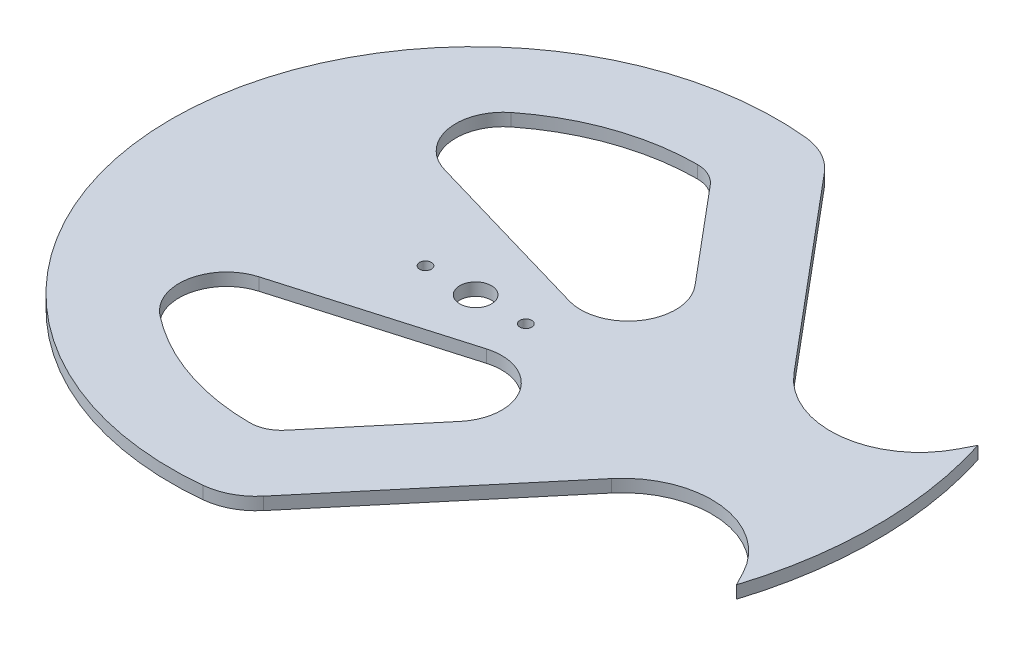
ISO-10303-21;
HEADER;
FILE_DESCRIPTION(('STEP AP214'),'2;1');
FILE_NAME('part.step','',(''),(''),'','','');
FILE_SCHEMA(('AUTOMOTIVE_DESIGN { 1 0 10303 214 1 1 1 1 }'));
ENDSEC;
DATA;
#1=APPLICATION_CONTEXT('core data for automotive mechanical design processes');
#2=APPLICATION_PROTOCOL_DEFINITION('international standard','automotive_design',2000,#1);
#3=PRODUCT_CONTEXT('',#1,'mechanical');
#4=PRODUCT('Part','Part','',(#3));
#5=PRODUCT_RELATED_PRODUCT_CATEGORY('part','',(#4));
#6=PRODUCT_DEFINITION_FORMATION('','',#4);
#7=PRODUCT_DEFINITION_CONTEXT('part definition',#1,'design');
#8=PRODUCT_DEFINITION('design','',#6,#7);
#9=PRODUCT_DEFINITION_SHAPE('','',#8);
#10=(LENGTH_UNIT() NAMED_UNIT(*) SI_UNIT(.MILLI.,.METRE.));
#11=(NAMED_UNIT(*) PLANE_ANGLE_UNIT() SI_UNIT($,.RADIAN.));
#12=(NAMED_UNIT(*) SI_UNIT($,.STERADIAN.) SOLID_ANGLE_UNIT());
#13=UNCERTAINTY_MEASURE_WITH_UNIT(LENGTH_MEASURE(1.E-05),#10,'distance_accuracy_value','');
#14=(GEOMETRIC_REPRESENTATION_CONTEXT(3) GLOBAL_UNCERTAINTY_ASSIGNED_CONTEXT((#13)) GLOBAL_UNIT_ASSIGNED_CONTEXT((#10,
#11,#12)) REPRESENTATION_CONTEXT('',''));
#15=CARTESIAN_POINT('',(0.,0.,0.));
#16=DIRECTION('',(0.,0.,1.));
#17=DIRECTION('',(1.,0.,0.));
#18=AXIS2_PLACEMENT_3D('',#15,#16,#17);
#19=CARTESIAN_POINT('',(0.,3.175,0.));
#20=DIRECTION('',(0.,-1.,0.));
#21=DIRECTION('',(0.,0.,-1.));
#22=AXIS2_PLACEMENT_3D('',#19,#20,#21);
#23=PLANE('',#22);
#24=CARTESIAN_POINT('',(-12.3213636381128,3.175,0.));
#25=DIRECTION('',(0.,1.,0.));
#26=DIRECTION('',(0.,0.,1.));
#27=AXIS2_PLACEMENT_3D('',#24,#25,#26);
#28=CIRCLE('',#27,1.5);
#29=CARTESIAN_POINT('',(-12.3213636381128,3.175,1.5));
#30=VERTEX_POINT('',#29);
#31=EDGE_CURVE('E713',#30,#30,#28,.T.);
#32=ORIENTED_EDGE('',*,*,#31,.F.);
#33=EDGE_LOOP('',(#32));
#34=FACE_BOUND('',#33,.T.);
#35=CARTESIAN_POINT('',(13.0786363618872,3.175,0.));
#36=DIRECTION('',(0.,1.,0.));
#37=DIRECTION('',(0.,0.,1.));
#38=AXIS2_PLACEMENT_3D('',#35,#36,#37);
#39=CIRCLE('',#38,1.5);
#40=CARTESIAN_POINT('',(13.0786363618872,3.175,1.5));
#41=VERTEX_POINT('',#40);
#42=EDGE_CURVE('E718',#41,#41,#39,.T.);
#43=ORIENTED_EDGE('',*,*,#42,.F.);
#44=EDGE_LOOP('',(#43));
#45=FACE_BOUND('',#44,.T.);
#46=CARTESIAN_POINT('',(0.378636361887175,3.175,0.));
#47=DIRECTION('',(0.,1.,0.));
#48=DIRECTION('',(0.,0.,1.));
#49=AXIS2_PLACEMENT_3D('',#46,#47,#48);
#50=CIRCLE('',#49,4.);
#51=CARTESIAN_POINT('',(0.378636361887175,3.175,4.));
#52=VERTEX_POINT('',#51);
#53=EDGE_CURVE('E230',#52,#52,#50,.T.);
#54=ORIENTED_EDGE('',*,*,#53,.F.);
#55=EDGE_LOOP('',(#54));
#56=FACE_BOUND('',#55,.T.);
#57=CARTESIAN_POINT('',(-0.144220654744044,3.175,-48.5997860119028));
#58=DIRECTION('',(0.,1.,0.));
#59=DIRECTION('',(0.,0.,-1.));
#60=AXIS2_PLACEMENT_3D('',#57,#58,#59);
#61=CIRCLE('',#60,8.);
#62=CARTESIAN_POINT('',(5.98413489020778,3.175,-53.7420868893951));
#63=VERTEX_POINT('',#62);
#64=CARTESIAN_POINT('',(-0.167960680216297,3.175,-56.5997507875247));
#65=VERTEX_POINT('',#64);
#66=EDGE_CURVE('E260',#63,#65,#61,.T.);
#67=ORIENTED_EDGE('',*,*,#66,.F.);
#68=DIRECTION('',(-0.642787609686538,0.,-0.766044443118979));
#69=VECTOR('',#68,1.);
#70=CARTESIAN_POINT('',(5.98413489020778,3.175,-53.7420868893951));
#71=LINE('',#70,#69);
#72=CARTESIAN_POINT('',(26.1465541373368,3.175,-29.7134513162384));
#73=VERTEX_POINT('',#72);
#74=EDGE_CURVE('E277',#73,#63,#71,.T.);
#75=ORIENTED_EDGE('',*,*,#74,.F.);
#76=CARTESIAN_POINT('',(16.954020819909,3.175,-22.));
#77=DIRECTION('',(0.,1.,0.));
#78=DIRECTION('',(0.,0.,-1.));
#79=AXIS2_PLACEMENT_3D('',#76,#77,#78);
#80=CIRCLE('',#79,12.);
#81=CARTESIAN_POINT('',(13.595828747128,3.175,-10.4794728418223));
#82=VERTEX_POINT('',#81);
#83=EDGE_CURVE('E273',#82,#73,#80,.T.);
#84=ORIENTED_EDGE('',*,*,#83,.F.);
#85=DIRECTION('',(0.960043929848145,0.,0.279849339398417));
#86=VECTOR('',#85,1.);
#87=CARTESIAN_POINT('',(13.595828747128,3.175,-10.4794728418223));
#88=LINE('',#87,#86);
#89=CARTESIAN_POINT('',(-31.0016361418546,3.175,-23.4794728418223));
#90=VERTEX_POINT('',#89);
#91=EDGE_CURVE('E270',#90,#82,#88,.T.);
#92=ORIENTED_EDGE('',*,*,#91,.F.);
#93=CARTESIAN_POINT('',(-27.6434440690736,3.175,-35.));
#94=DIRECTION('',(0.,1.,0.));
#95=DIRECTION('',(0.,0.,1.));
#96=AXIS2_PLACEMENT_3D('',#93,#94,#95);
#97=CIRCLE('',#96,12.);
#98=CARTESIAN_POINT('',(-35.0811420248781,3.175,-44.4170403587444));
#99=VERTEX_POINT('',#98);
#100=EDGE_CURVE('E267',#99,#90,#97,.T.);
#101=ORIENTED_EDGE('',*,*,#100,.F.);
#102=CARTESIAN_POINT('',(0.,3.175,0.));
#103=DIRECTION('',(0.,1.,0.));
#104=DIRECTION('',(0.,0.,1.));
#105=AXIS2_PLACEMENT_3D('',#102,#103,#104);
#106=CIRCLE('',#105,56.6);
#107=EDGE_CURVE('E263',#65,#99,#106,.T.);
#108=ORIENTED_EDGE('',*,*,#107,.F.);
#109=EDGE_LOOP('',(#67,#75,#84,#92,#101,#108));
#110=FACE_BOUND('',#109,.T.);
#111=CARTESIAN_POINT('',(0.,3.175,0.));
#112=DIRECTION('',(0.,1.,0.));
#113=DIRECTION('',(0.,0.,-1.));
#114=AXIS2_PLACEMENT_3D('',#111,#112,#113);
#115=CIRCLE('',#114,101.6);
#116=CARTESIAN_POINT('',(96.8976421960199,3.175,30.5517092296339));
#117=VERTEX_POINT('',#116);
#118=CARTESIAN_POINT('',(96.8976421960199,3.175,-30.5517092296339));
#119=VERTEX_POINT('',#118);
#120=EDGE_CURVE('E323',#117,#119,#115,.T.);
#121=ORIENTED_EDGE('',*,*,#120,.T.);
#122=DIRECTION('',(-0.461748613235041,0.,0.887010833178218));
#123=VECTOR('',#122,1.);
#124=CARTESIAN_POINT('',(96.8976421960199,3.175,-30.5517092296339));
#125=LINE('',#124,#123);
#126=CARTESIAN_POINT('',(95.1209457916625,3.175,-27.1387071918094));
#127=VERTEX_POINT('',#126);
#128=EDGE_CURVE('E327',#119,#127,#125,.T.);
#129=ORIENTED_EDGE('',*,*,#128,.T.);
#130=CARTESIAN_POINT('',(75.1169754449685,3.175,-37.5521150345125));
#131=DIRECTION('',(0.,-1.,0.));
#132=DIRECTION('',(0.,0.,-1.));
#133=AXIS2_PLACEMENT_3D('',#130,#131,#132);
#134=CIRCLE('',#133,22.5521150345125);
#135=CARTESIAN_POINT('',(57.8410530422002,3.175,-23.0558949181024));
#136=VERTEX_POINT('',#135);
#137=EDGE_CURVE('E331',#127,#136,#134,.T.);
#138=ORIENTED_EDGE('',*,*,#137,.T.);
#139=DIRECTION('',(-0.642787609686538,0.,-0.766044443118979));
#140=VECTOR('',#139,1.);
#141=CARTESIAN_POINT('',(17.668897816436,3.175,-70.9312052306592));
#142=LINE('',#141,#140);
#143=CARTESIAN_POINT('',(17.668897816436,3.175,-70.9312052306592));
#144=VERTEX_POINT('',#143);
#145=EDGE_CURVE('E334',#136,#144,#142,.T.);
#146=ORIENTED_EDGE('',*,*,#145,.T.);
#147=CARTESIAN_POINT('',(6.17823116965135,3.175,-61.2893910853612));
#148=DIRECTION('',(0.,1.,0.));
#149=DIRECTION('',(0.,0.,-1.));
#150=AXIS2_PLACEMENT_3D('',#147,#148,#149);
#151=CIRCLE('',#150,15.);
#152=CARTESIAN_POINT('',(7.68267057784568,3.175,-76.2137557977056));
#153=VERTEX_POINT('',#152);
#154=EDGE_CURVE('E337',#144,#153,#151,.T.);
#155=ORIENTED_EDGE('',*,*,#154,.T.);
#156=CARTESIAN_POINT('',(0.,3.175,0.));
#157=DIRECTION('',(0.,1.,0.));
#158=DIRECTION('',(0.,0.,1.));
#159=AXIS2_PLACEMENT_3D('',#156,#157,#158);
#160=CIRCLE('',#159,76.6);
#161=CARTESIAN_POINT('',(7.68267057784568,3.175,76.2137557977056));
#162=VERTEX_POINT('',#161);
#163=EDGE_CURVE('E340',#153,#162,#160,.T.);
#164=ORIENTED_EDGE('',*,*,#163,.T.);
#165=CARTESIAN_POINT('',(6.17823116965135,3.175,61.2893910853612));
#166=DIRECTION('',(0.,1.,0.));
#167=DIRECTION('',(0.,0.,1.));
#168=AXIS2_PLACEMENT_3D('',#165,#166,#167);
#169=CIRCLE('',#168,15.);
#170=CARTESIAN_POINT('',(17.668897816436,3.175,70.9312052306592));
#171=VERTEX_POINT('',#170);
#172=EDGE_CURVE('E343',#162,#171,#169,.T.);
#173=ORIENTED_EDGE('',*,*,#172,.T.);
#174=DIRECTION('',(0.642787609686538,0.,-0.766044443118979));
#175=VECTOR('',#174,1.);
#176=CARTESIAN_POINT('',(17.668897816436,3.175,70.9312052306592));
#177=LINE('',#176,#175);
#178=CARTESIAN_POINT('',(57.8410530422002,3.175,23.0558949181024));
#179=VERTEX_POINT('',#178);
#180=EDGE_CURVE('E346',#171,#179,#177,.T.);
#181=ORIENTED_EDGE('',*,*,#180,.T.);
#182=CARTESIAN_POINT('',(75.1169754449685,3.175,37.5521150345125));
#183=DIRECTION('',(0.,-1.,0.));
#184=DIRECTION('',(0.,0.,1.));
#185=AXIS2_PLACEMENT_3D('',#182,#183,#184);
#186=CIRCLE('',#185,22.5521150345125);
#187=CARTESIAN_POINT('',(95.1209457916625,3.175,27.1387071918094));
#188=VERTEX_POINT('',#187);
#189=EDGE_CURVE('E349',#179,#188,#186,.T.);
#190=ORIENTED_EDGE('',*,*,#189,.T.);
#191=DIRECTION('',(0.461748613235041,0.,0.887010833178218));
#192=VECTOR('',#191,1.);
#193=CARTESIAN_POINT('',(96.8976421960199,3.175,30.5517092296339));
#194=LINE('',#193,#192);
#195=EDGE_CURVE('E352',#188,#117,#194,.T.);
#196=ORIENTED_EDGE('',*,*,#195,.T.);
#197=EDGE_LOOP('',(#121,#129,#138,#146,#155,#164,#173,#181,#190,#196));
#198=FACE_BOUND('',#197,.T.);
#199=CARTESIAN_POINT('',(16.954020819909,3.175,22.));
#200=DIRECTION('',(0.,1.,0.));
#201=DIRECTION('',(0.,0.,1.));
#202=AXIS2_PLACEMENT_3D('',#199,#200,#201);
#203=CIRCLE('',#202,12.);
#204=CARTESIAN_POINT('',(26.1465541373368,3.175,29.7134513162384));
#205=VERTEX_POINT('',#204);
#206=CARTESIAN_POINT('',(13.595828747128,3.175,10.4794728418223));
#207=VERTEX_POINT('',#206);
#208=EDGE_CURVE('E189',#205,#207,#203,.T.);
#209=ORIENTED_EDGE('',*,*,#208,.F.);
#210=DIRECTION('',(0.642787609686538,0.,-0.766044443118979));
#211=VECTOR('',#210,1.);
#212=CARTESIAN_POINT('',(5.98413489020778,3.175,53.7420868893951));
#213=LINE('',#212,#211);
#214=CARTESIAN_POINT('',(5.98413489020779,3.175,53.7420868893951));
#215=VERTEX_POINT('',#214);
#216=EDGE_CURVE('E225',#215,#205,#213,.T.);
#217=ORIENTED_EDGE('',*,*,#216,.F.);
#218=CARTESIAN_POINT('',(-0.144220654744044,3.175,48.5997860119028));
#219=DIRECTION('',(0.,1.,0.));
#220=DIRECTION('',(0.,0.,1.));
#221=AXIS2_PLACEMENT_3D('',#218,#219,#220);
#222=CIRCLE('',#221,8.);
#223=CARTESIAN_POINT('',(-0.167960680216315,3.175,56.5997507875247));
#224=VERTEX_POINT('',#223);
#225=EDGE_CURVE('E222',#224,#215,#222,.T.);
#226=ORIENTED_EDGE('',*,*,#225,.F.);
#227=CARTESIAN_POINT('',(0.,3.175,0.));
#228=DIRECTION('',(0.,1.,0.));
#229=DIRECTION('',(0.,0.,-1.));
#230=AXIS2_PLACEMENT_3D('',#227,#228,#229);
#231=CIRCLE('',#230,56.6);
#232=CARTESIAN_POINT('',(-35.0811420248781,3.175,44.4170403587444));
#233=VERTEX_POINT('',#232);
#234=EDGE_CURVE('E216',#233,#224,#231,.T.);
#235=ORIENTED_EDGE('',*,*,#234,.F.);
#236=CARTESIAN_POINT('',(-27.6434440690736,3.175,35.));
#237=DIRECTION('',(0.,1.,0.));
#238=DIRECTION('',(0.,0.,-1.));
#239=AXIS2_PLACEMENT_3D('',#236,#237,#238);
#240=CIRCLE('',#239,12.);
#241=CARTESIAN_POINT('',(-31.0016361418546,3.175,23.4794728418223));
#242=VERTEX_POINT('',#241);
#243=EDGE_CURVE('E212',#242,#233,#240,.T.);
#244=ORIENTED_EDGE('',*,*,#243,.F.);
#245=DIRECTION('',(-0.960043929848145,0.,0.279849339398417));
#246=VECTOR('',#245,1.);
#247=CARTESIAN_POINT('',(13.595828747128,3.175,10.4794728418223));
#248=LINE('',#247,#246);
#249=EDGE_CURVE('E198',#207,#242,#248,.T.);
#250=ORIENTED_EDGE('',*,*,#249,.F.);
#251=EDGE_LOOP('',(#209,#217,#226,#235,#244,#250));
#252=FACE_BOUND('',#251,.T.);
#253=ADVANCED_FACE('F39',(#34,#45,#56,#110,#198,#252),#23,.F.);
#254=CARTESIAN_POINT('',(0.,0.,0.));
#255=DIRECTION('',(0.,-1.,0.));
#256=DIRECTION('',(0.,0.,-1.));
#257=AXIS2_PLACEMENT_3D('',#254,#255,#256);
#258=PLANE('',#257);
#259=CARTESIAN_POINT('',(-12.3213636381128,0.,0.));
#260=DIRECTION('',(0.,1.,0.));
#261=DIRECTION('',(0.,0.,1.));
#262=AXIS2_PLACEMENT_3D('',#259,#260,#261);
#263=CIRCLE('',#262,1.5);
#264=CARTESIAN_POINT('',(-12.3213636381128,0.,1.5));
#265=VERTEX_POINT('',#264);
#266=EDGE_CURVE('E716',#265,#265,#263,.T.);
#267=ORIENTED_EDGE('',*,*,#266,.T.);
#268=EDGE_LOOP('',(#267));
#269=FACE_BOUND('',#268,.T.);
#270=CARTESIAN_POINT('',(13.0786363618872,0.,0.));
#271=DIRECTION('',(0.,1.,0.));
#272=DIRECTION('',(0.,0.,1.));
#273=AXIS2_PLACEMENT_3D('',#270,#271,#272);
#274=CIRCLE('',#273,1.5);
#275=CARTESIAN_POINT('',(13.0786363618872,0.,1.5));
#276=VERTEX_POINT('',#275);
#277=EDGE_CURVE('E725',#276,#276,#274,.T.);
#278=ORIENTED_EDGE('',*,*,#277,.T.);
#279=EDGE_LOOP('',(#278));
#280=FACE_BOUND('',#279,.T.);
#281=CARTESIAN_POINT('',(0.378636361887175,0.,0.));
#282=DIRECTION('',(0.,1.,0.));
#283=DIRECTION('',(0.,0.,1.));
#284=AXIS2_PLACEMENT_3D('',#281,#282,#283);
#285=CIRCLE('',#284,4.);
#286=CARTESIAN_POINT('',(0.378636361887175,0.,4.));
#287=VERTEX_POINT('',#286);
#288=EDGE_CURVE('E722',#287,#287,#285,.T.);
#289=ORIENTED_EDGE('',*,*,#288,.T.);
#290=EDGE_LOOP('',(#289));
#291=FACE_BOUND('',#290,.T.);
#292=CARTESIAN_POINT('',(0.,0.,0.));
#293=DIRECTION('',(0.,1.,0.));
#294=DIRECTION('',(0.,0.,-1.));
#295=AXIS2_PLACEMENT_3D('',#292,#293,#294);
#296=CIRCLE('',#295,101.6);
#297=CARTESIAN_POINT('',(96.8976421960199,0.,30.5517092296339));
#298=VERTEX_POINT('',#297);
#299=CARTESIAN_POINT('',(96.8976421960199,0.,-30.5517092296339));
#300=VERTEX_POINT('',#299);
#301=EDGE_CURVE('E322',#298,#300,#296,.T.);
#302=ORIENTED_EDGE('',*,*,#301,.F.);
#303=DIRECTION('',(0.461748613235041,0.,0.887010833178218));
#304=VECTOR('',#303,1.);
#305=CARTESIAN_POINT('',(96.8976421960199,0.,30.5517092296339));
#306=LINE('',#305,#304);
#307=CARTESIAN_POINT('',(95.1209457916625,0.,27.1387071918094));
#308=VERTEX_POINT('',#307);
#309=EDGE_CURVE('E328',#308,#298,#306,.T.);
#310=ORIENTED_EDGE('',*,*,#309,.F.);
#311=CARTESIAN_POINT('',(75.1169754449685,0.,37.5521150345125));
#312=DIRECTION('',(0.,-1.,0.));
#313=DIRECTION('',(0.,0.,1.));
#314=AXIS2_PLACEMENT_3D('',#311,#312,#313);
#315=CIRCLE('',#314,22.5521150345125);
#316=CARTESIAN_POINT('',(57.8410530422002,0.,23.0558949181024));
#317=VERTEX_POINT('',#316);
#318=EDGE_CURVE('E380',#317,#308,#315,.T.);
#319=ORIENTED_EDGE('',*,*,#318,.F.);
#320=DIRECTION('',(0.642787609686538,0.,-0.766044443118979));
#321=VECTOR('',#320,1.);
#322=CARTESIAN_POINT('',(17.668897816436,0.,70.9312052306592));
#323=LINE('',#322,#321);
#324=CARTESIAN_POINT('',(17.668897816436,0.,70.9312052306592));
#325=VERTEX_POINT('',#324);
#326=EDGE_CURVE('E377',#325,#317,#323,.T.);
#327=ORIENTED_EDGE('',*,*,#326,.F.);
#328=CARTESIAN_POINT('',(6.17823116965135,0.,61.2893910853612));
#329=DIRECTION('',(0.,1.,0.));
#330=DIRECTION('',(0.,0.,1.));
#331=AXIS2_PLACEMENT_3D('',#328,#329,#330);
#332=CIRCLE('',#331,15.);
#333=CARTESIAN_POINT('',(7.68267057784568,0.,76.2137557977056));
#334=VERTEX_POINT('',#333);
#335=EDGE_CURVE('E374',#334,#325,#332,.T.);
#336=ORIENTED_EDGE('',*,*,#335,.F.);
#337=CARTESIAN_POINT('',(0.,0.,0.));
#338=DIRECTION('',(0.,1.,0.));
#339=DIRECTION('',(0.,0.,1.));
#340=AXIS2_PLACEMENT_3D('',#337,#338,#339);
#341=CIRCLE('',#340,76.6);
#342=CARTESIAN_POINT('',(7.68267057784568,0.,-76.2137557977056));
#343=VERTEX_POINT('',#342);
#344=EDGE_CURVE('E371',#343,#334,#341,.T.);
#345=ORIENTED_EDGE('',*,*,#344,.F.);
#346=CARTESIAN_POINT('',(6.17823116965135,0.,-61.2893910853612));
#347=DIRECTION('',(0.,1.,0.));
#348=DIRECTION('',(0.,0.,-1.));
#349=AXIS2_PLACEMENT_3D('',#346,#347,#348);
#350=CIRCLE('',#349,15.);
#351=CARTESIAN_POINT('',(17.668897816436,0.,-70.9312052306592));
#352=VERTEX_POINT('',#351);
#353=EDGE_CURVE('E368',#352,#343,#350,.T.);
#354=ORIENTED_EDGE('',*,*,#353,.F.);
#355=DIRECTION('',(-0.642787609686538,0.,-0.766044443118979));
#356=VECTOR('',#355,1.);
#357=CARTESIAN_POINT('',(17.668897816436,0.,-70.9312052306592));
#358=LINE('',#357,#356);
#359=CARTESIAN_POINT('',(57.8410530422002,0.,-23.0558949181024));
#360=VERTEX_POINT('',#359);
#361=EDGE_CURVE('E365',#360,#352,#358,.T.);
#362=ORIENTED_EDGE('',*,*,#361,.F.);
#363=CARTESIAN_POINT('',(75.1169754449685,0.,-37.5521150345125));
#364=DIRECTION('',(0.,-1.,0.));
#365=DIRECTION('',(0.,0.,-1.));
#366=AXIS2_PLACEMENT_3D('',#363,#364,#365);
#367=CIRCLE('',#366,22.5521150345125);
#368=CARTESIAN_POINT('',(95.1209457916625,0.,-27.1387071918094));
#369=VERTEX_POINT('',#368);
#370=EDGE_CURVE('E362',#369,#360,#367,.T.);
#371=ORIENTED_EDGE('',*,*,#370,.F.);
#372=DIRECTION('',(-0.461748613235041,0.,0.887010833178218));
#373=VECTOR('',#372,1.);
#374=CARTESIAN_POINT('',(96.8976421960199,0.,-30.5517092296339));
#375=LINE('',#374,#373);
#376=EDGE_CURVE('E359',#300,#369,#375,.T.);
#377=ORIENTED_EDGE('',*,*,#376,.F.);
#378=EDGE_LOOP('',(#302,#310,#319,#327,#336,#345,#354,#362,#371,#377));
#379=FACE_BOUND('',#378,.T.);
#380=DIRECTION('',(-0.642787609686538,0.,-0.766044443118979));
#381=VECTOR('',#380,1.);
#382=CARTESIAN_POINT('',(5.98413489020778,0.,-53.7420868893951));
#383=LINE('',#382,#381);
#384=CARTESIAN_POINT('',(26.1465541373368,0.,-29.7134513162384));
#385=VERTEX_POINT('',#384);
#386=CARTESIAN_POINT('',(5.98413489020779,0.,-53.7420868893951));
#387=VERTEX_POINT('',#386);
#388=EDGE_CURVE('E264',#385,#387,#383,.T.);
#389=ORIENTED_EDGE('',*,*,#388,.T.);
#390=CARTESIAN_POINT('',(-0.144220654744044,0.,-48.5997860119028));
#391=DIRECTION('',(0.,1.,0.));
#392=DIRECTION('',(0.,0.,-1.));
#393=AXIS2_PLACEMENT_3D('',#390,#391,#392);
#394=CIRCLE('',#393,8.);
#395=CARTESIAN_POINT('',(-0.167960680216297,0.,-56.5997507875247));
#396=VERTEX_POINT('',#395);
#397=EDGE_CURVE('E207',#387,#396,#394,.T.);
#398=ORIENTED_EDGE('',*,*,#397,.T.);
#399=CARTESIAN_POINT('',(0.,0.,0.));
#400=DIRECTION('',(0.,1.,0.));
#401=DIRECTION('',(0.,0.,1.));
#402=AXIS2_PLACEMENT_3D('',#399,#400,#401);
#403=CIRCLE('',#402,56.6);
#404=CARTESIAN_POINT('',(-35.0811420248781,0.,-44.4170403587444));
#405=VERTEX_POINT('',#404);
#406=EDGE_CURVE('E284',#396,#405,#403,.T.);
#407=ORIENTED_EDGE('',*,*,#406,.T.);
#408=CARTESIAN_POINT('',(-27.6434440690736,0.,-35.));
#409=DIRECTION('',(0.,1.,0.));
#410=DIRECTION('',(0.,0.,1.));
#411=AXIS2_PLACEMENT_3D('',#408,#409,#410);
#412=CIRCLE('',#411,12.);
#413=CARTESIAN_POINT('',(-31.0016361418546,0.,-23.4794728418223));
#414=VERTEX_POINT('',#413);
#415=EDGE_CURVE('E288',#405,#414,#412,.T.);
#416=ORIENTED_EDGE('',*,*,#415,.T.);
#417=DIRECTION('',(0.960043929848145,0.,0.279849339398417));
#418=VECTOR('',#417,1.);
#419=CARTESIAN_POINT('',(13.595828747128,0.,-10.4794728418223));
#420=LINE('',#419,#418);
#421=CARTESIAN_POINT('',(13.595828747128,0.,-10.4794728418223));
#422=VERTEX_POINT('',#421);
#423=EDGE_CURVE('E292',#414,#422,#420,.T.);
#424=ORIENTED_EDGE('',*,*,#423,.T.);
#425=CARTESIAN_POINT('',(16.954020819909,0.,-22.));
#426=DIRECTION('',(0.,1.,0.));
#427=DIRECTION('',(0.,0.,-1.));
#428=AXIS2_PLACEMENT_3D('',#425,#426,#427);
#429=CIRCLE('',#428,12.);
#430=EDGE_CURVE('E296',#422,#385,#429,.T.);
#431=ORIENTED_EDGE('',*,*,#430,.T.);
#432=EDGE_LOOP('',(#389,#398,#407,#416,#424,#431));
#433=FACE_BOUND('',#432,.T.);
#434=DIRECTION('',(0.642787609686538,0.,-0.766044443118979));
#435=VECTOR('',#434,1.);
#436=CARTESIAN_POINT('',(5.98413489020778,0.,53.7420868893951));
#437=LINE('',#436,#435);
#438=CARTESIAN_POINT('',(5.98413489020778,0.,53.7420868893951));
#439=VERTEX_POINT('',#438);
#440=CARTESIAN_POINT('',(26.1465541373368,0.,29.7134513162384));
#441=VERTEX_POINT('',#440);
#442=EDGE_CURVE('E199',#439,#441,#437,.T.);
#443=ORIENTED_EDGE('',*,*,#442,.T.);
#444=CARTESIAN_POINT('',(16.954020819909,0.,22.));
#445=DIRECTION('',(0.,1.,0.));
#446=DIRECTION('',(0.,0.,1.));
#447=AXIS2_PLACEMENT_3D('',#444,#445,#446);
#448=CIRCLE('',#447,12.);
#449=CARTESIAN_POINT('',(13.595828747128,0.,10.4794728418223));
#450=VERTEX_POINT('',#449);
#451=EDGE_CURVE('E63',#441,#450,#448,.T.);
#452=ORIENTED_EDGE('',*,*,#451,.T.);
#453=DIRECTION('',(-0.960043929848145,0.,0.279849339398417));
#454=VECTOR('',#453,1.);
#455=CARTESIAN_POINT('',(13.595828747128,0.,10.4794728418223));
#456=LINE('',#455,#454);
#457=CARTESIAN_POINT('',(-31.0016361418546,0.,23.4794728418223));
#458=VERTEX_POINT('',#457);
#459=EDGE_CURVE('E205',#450,#458,#456,.T.);
#460=ORIENTED_EDGE('',*,*,#459,.T.);
#461=CARTESIAN_POINT('',(-27.6434440690736,0.,35.));
#462=DIRECTION('',(0.,1.,0.));
#463=DIRECTION('',(0.,0.,-1.));
#464=AXIS2_PLACEMENT_3D('',#461,#462,#463);
#465=CIRCLE('',#464,12.);
#466=CARTESIAN_POINT('',(-35.0811420248781,0.,44.4170403587444));
#467=VERTEX_POINT('',#466);
#468=EDGE_CURVE('E233',#458,#467,#465,.T.);
#469=ORIENTED_EDGE('',*,*,#468,.T.);
#470=CARTESIAN_POINT('',(0.,0.,0.));
#471=DIRECTION('',(0.,1.,0.));
#472=DIRECTION('',(0.,0.,-1.));
#473=AXIS2_PLACEMENT_3D('',#470,#471,#472);
#474=CIRCLE('',#473,56.6);
#475=CARTESIAN_POINT('',(-0.167960680216315,0.,56.5997507875247));
#476=VERTEX_POINT('',#475);
#477=EDGE_CURVE('E237',#467,#476,#474,.T.);
#478=ORIENTED_EDGE('',*,*,#477,.T.);
#479=CARTESIAN_POINT('',(-0.144220654744044,0.,48.5997860119028));
#480=DIRECTION('',(0.,1.,0.));
#481=DIRECTION('',(0.,0.,1.));
#482=AXIS2_PLACEMENT_3D('',#479,#480,#481);
#483=CIRCLE('',#482,8.);
#484=EDGE_CURVE('E241',#476,#439,#483,.T.);
#485=ORIENTED_EDGE('',*,*,#484,.T.);
#486=EDGE_LOOP('',(#443,#452,#460,#469,#478,#485));
#487=FACE_BOUND('',#486,.T.);
#488=ADVANCED_FACE('F427',(#269,#280,#291,#379,#433,#487),#258,.T.);
#489=CARTESIAN_POINT('',(0.,3.175,0.));
#490=DIRECTION('',(0.,-1.,0.));
#491=DIRECTION('',(0.,0.,-1.));
#492=AXIS2_PLACEMENT_3D('',#489,#490,#491);
#493=CYLINDRICAL_SURFACE('',#492,101.6);
#494=ORIENTED_EDGE('',*,*,#301,.T.);
#495=DIRECTION('',(0.,-1.,0.));
#496=VECTOR('',#495,1.);
#497=CARTESIAN_POINT('',(96.8976421960199,3.175,-30.5517092296339));
#498=LINE('',#497,#496);
#499=EDGE_CURVE('E11',#119,#300,#498,.T.);
#500=ORIENTED_EDGE('',*,*,#499,.F.);
#501=ORIENTED_EDGE('',*,*,#120,.F.);
#502=DIRECTION('',(0.,-1.,0.));
#503=VECTOR('',#502,1.);
#504=CARTESIAN_POINT('',(96.8976421960199,3.175,30.5517092296339));
#505=LINE('',#504,#503);
#506=EDGE_CURVE('E355',#117,#298,#505,.T.);
#507=ORIENTED_EDGE('',*,*,#506,.T.);
#508=EDGE_LOOP('',(#494,#500,#501,#507));
#509=FACE_BOUND('',#508,.T.);
#510=ADVANCED_FACE('F41',(#509),#493,.T.);
#511=CARTESIAN_POINT('',(96.8976421960199,3.175,-30.5517092296339));
#512=DIRECTION('',(0.887010833178218,0.,0.461748613235041));
#513=DIRECTION('',(0.461748613235041,0.,-0.887010833178218));
#514=AXIS2_PLACEMENT_3D('',#511,#512,#513);
#515=PLANE('',#514);
#516=ORIENTED_EDGE('',*,*,#376,.T.);
#517=DIRECTION('',(0.,-1.,0.));
#518=VECTOR('',#517,1.);
#519=CARTESIAN_POINT('',(95.1209457916625,3.175,-27.1387071918094));
#520=LINE('',#519,#518);
#521=EDGE_CURVE('E48',#127,#369,#520,.T.);
#522=ORIENTED_EDGE('',*,*,#521,.F.);
#523=ORIENTED_EDGE('',*,*,#128,.F.);
#524=ORIENTED_EDGE('',*,*,#499,.T.);
#525=EDGE_LOOP('',(#516,#522,#523,#524));
#526=FACE_BOUND('',#525,.T.);
#527=ADVANCED_FACE('F444',(#526),#515,.F.);
#528=CARTESIAN_POINT('',(75.1169754449685,3.175,-37.5521150345125));
#529=DIRECTION('',(0.,-1.,0.));
#530=DIRECTION('',(0.,0.,-1.));
#531=AXIS2_PLACEMENT_3D('',#528,#529,#530);
#532=CYLINDRICAL_SURFACE('',#531,22.5521150345125);
#533=ORIENTED_EDGE('',*,*,#370,.T.);
#534=DIRECTION('',(0.,-1.,0.));
#535=VECTOR('',#534,1.);
#536=CARTESIAN_POINT('',(57.8410530422002,3.175,-23.0558949181024));
#537=LINE('',#536,#535);
#538=EDGE_CURVE('E412',#136,#360,#537,.T.);
#539=ORIENTED_EDGE('',*,*,#538,.F.);
#540=ORIENTED_EDGE('',*,*,#137,.F.);
#541=ORIENTED_EDGE('',*,*,#521,.T.);
#542=EDGE_LOOP('',(#533,#539,#540,#541));
#543=FACE_BOUND('',#542,.T.);
#544=ADVANCED_FACE('F421',(#543),#532,.F.);
#545=CARTESIAN_POINT('',(17.668897816436,3.175,-70.9312052306592));
#546=DIRECTION('',(-0.766044443118979,0.,0.642787609686538));
#547=DIRECTION('',(0.642787609686538,0.,0.766044443118979));
#548=AXIS2_PLACEMENT_3D('',#545,#546,#547);
#549=PLANE('',#548);
#550=ORIENTED_EDGE('',*,*,#361,.T.);
#551=DIRECTION('',(0.,-1.,0.));
#552=VECTOR('',#551,1.);
#553=CARTESIAN_POINT('',(17.668897816436,3.175,-70.9312052306592));
#554=LINE('',#553,#552);
#555=EDGE_CURVE('E408',#144,#352,#554,.T.);
#556=ORIENTED_EDGE('',*,*,#555,.F.);
#557=ORIENTED_EDGE('',*,*,#145,.F.);
#558=ORIENTED_EDGE('',*,*,#538,.T.);
#559=EDGE_LOOP('',(#550,#556,#557,#558));
#560=FACE_BOUND('',#559,.T.);
#561=ADVANCED_FACE('F433',(#560),#549,.F.);
#562=CARTESIAN_POINT('',(6.17823116965135,3.175,-61.2893910853612));
#563=DIRECTION('',(0.,-1.,0.));
#564=DIRECTION('',(0.,0.,-1.));
#565=AXIS2_PLACEMENT_3D('',#562,#563,#564);
#566=CYLINDRICAL_SURFACE('',#565,15.);
#567=ORIENTED_EDGE('',*,*,#353,.T.);
#568=DIRECTION('',(0.,-1.,0.));
#569=VECTOR('',#568,1.);
#570=CARTESIAN_POINT('',(7.68267057784568,3.175,-76.2137557977056));
#571=LINE('',#570,#569);
#572=EDGE_CURVE('E404',#153,#343,#571,.T.);
#573=ORIENTED_EDGE('',*,*,#572,.F.);
#574=ORIENTED_EDGE('',*,*,#154,.F.);
#575=ORIENTED_EDGE('',*,*,#555,.T.);
#576=EDGE_LOOP('',(#567,#573,#574,#575));
#577=FACE_BOUND('',#576,.T.);
#578=ADVANCED_FACE('F437',(#577),#566,.T.);
#579=CARTESIAN_POINT('',(0.,3.175,0.));
#580=DIRECTION('',(0.,-1.,0.));
#581=DIRECTION('',(0.,0.,-1.));
#582=AXIS2_PLACEMENT_3D('',#579,#580,#581);
#583=CYLINDRICAL_SURFACE('',#582,76.6);
#584=ORIENTED_EDGE('',*,*,#344,.T.);
#585=DIRECTION('',(0.,-1.,0.));
#586=VECTOR('',#585,1.);
#587=CARTESIAN_POINT('',(7.68267057784568,3.175,76.2137557977056));
#588=LINE('',#587,#586);
#589=EDGE_CURVE('E400',#162,#334,#588,.T.);
#590=ORIENTED_EDGE('',*,*,#589,.F.);
#591=ORIENTED_EDGE('',*,*,#163,.F.);
#592=ORIENTED_EDGE('',*,*,#572,.T.);
#593=EDGE_LOOP('',(#584,#590,#591,#592));
#594=FACE_BOUND('',#593,.T.);
#595=ADVANCED_FACE('F467',(#594),#583,.T.);
#596=CARTESIAN_POINT('',(6.17823116965135,3.175,61.2893910853612));
#597=DIRECTION('',(0.,-1.,0.));
#598=DIRECTION('',(0.,0.,-1.));
#599=AXIS2_PLACEMENT_3D('',#596,#597,#598);
#600=CYLINDRICAL_SURFACE('',#599,15.);
#601=ORIENTED_EDGE('',*,*,#335,.T.);
#602=DIRECTION('',(0.,-1.,0.));
#603=VECTOR('',#602,1.);
#604=CARTESIAN_POINT('',(17.668897816436,3.175,70.9312052306592));
#605=LINE('',#604,#603);
#606=EDGE_CURVE('E396',#171,#325,#605,.T.);
#607=ORIENTED_EDGE('',*,*,#606,.F.);
#608=ORIENTED_EDGE('',*,*,#172,.F.);
#609=ORIENTED_EDGE('',*,*,#589,.T.);
#610=EDGE_LOOP('',(#601,#607,#608,#609));
#611=FACE_BOUND('',#610,.T.);
#612=ADVANCED_FACE('F464',(#611),#600,.T.);
#613=CARTESIAN_POINT('',(17.668897816436,3.175,70.9312052306592));
#614=DIRECTION('',(-0.766044443118979,0.,-0.642787609686538));
#615=DIRECTION('',(-0.642787609686538,0.,0.766044443118979));
#616=AXIS2_PLACEMENT_3D('',#613,#614,#615);
#617=PLANE('',#616);
#618=ORIENTED_EDGE('',*,*,#326,.T.);
#619=DIRECTION('',(0.,-1.,0.));
#620=VECTOR('',#619,1.);
#621=CARTESIAN_POINT('',(57.8410530422002,3.175,23.0558949181024));
#622=LINE('',#621,#620);
#623=EDGE_CURVE('E392',#179,#317,#622,.T.);
#624=ORIENTED_EDGE('',*,*,#623,.F.);
#625=ORIENTED_EDGE('',*,*,#180,.F.);
#626=ORIENTED_EDGE('',*,*,#606,.T.);
#627=EDGE_LOOP('',(#618,#624,#625,#626));
#628=FACE_BOUND('',#627,.T.);
#629=ADVANCED_FACE('F460',(#628),#617,.F.);
#630=CARTESIAN_POINT('',(75.1169754449685,3.175,37.5521150345125));
#631=DIRECTION('',(0.,-1.,0.));
#632=DIRECTION('',(0.,0.,-1.));
#633=AXIS2_PLACEMENT_3D('',#630,#631,#632);
#634=CYLINDRICAL_SURFACE('',#633,22.5521150345125);
#635=ORIENTED_EDGE('',*,*,#318,.T.);
#636=DIRECTION('',(0.,-1.,0.));
#637=VECTOR('',#636,1.);
#638=CARTESIAN_POINT('',(95.1209457916625,3.175,27.1387071918094));
#639=LINE('',#638,#637);
#640=EDGE_CURVE('E388',#188,#308,#639,.T.);
#641=ORIENTED_EDGE('',*,*,#640,.F.);
#642=ORIENTED_EDGE('',*,*,#189,.F.);
#643=ORIENTED_EDGE('',*,*,#623,.T.);
#644=EDGE_LOOP('',(#635,#641,#642,#643));
#645=FACE_BOUND('',#644,.T.);
#646=ADVANCED_FACE('F456',(#645),#634,.F.);
#647=CARTESIAN_POINT('',(96.8976421960199,3.175,30.5517092296339));
#648=DIRECTION('',(0.887010833178218,0.,-0.461748613235041));
#649=DIRECTION('',(-0.461748613235041,0.,-0.887010833178218));
#650=AXIS2_PLACEMENT_3D('',#647,#648,#649);
#651=PLANE('',#650);
#652=ORIENTED_EDGE('',*,*,#309,.T.);
#653=ORIENTED_EDGE('',*,*,#506,.F.);
#654=ORIENTED_EDGE('',*,*,#195,.F.);
#655=ORIENTED_EDGE('',*,*,#640,.T.);
#656=EDGE_LOOP('',(#652,#653,#654,#655));
#657=FACE_BOUND('',#656,.T.);
#658=ADVANCED_FACE('F451',(#657),#651,.F.);
#659=CARTESIAN_POINT('',(-0.144220654744044,3.175,-48.5997860119028));
#660=DIRECTION('',(0.,-1.,0.));
#661=DIRECTION('',(0.,0.,-1.));
#662=AXIS2_PLACEMENT_3D('',#659,#660,#661);
#663=CYLINDRICAL_SURFACE('',#662,8.);
#664=ORIENTED_EDGE('',*,*,#397,.F.);
#665=DIRECTION('',(0.,-1.,0.));
#666=VECTOR('',#665,1.);
#667=CARTESIAN_POINT('',(5.98413489020778,3.175,-53.7420868893951));
#668=LINE('',#667,#666);
#669=EDGE_CURVE('E280',#63,#387,#668,.T.);
#670=ORIENTED_EDGE('',*,*,#669,.F.);
#671=ORIENTED_EDGE('',*,*,#66,.T.);
#672=DIRECTION('',(0.,-1.,0.));
#673=VECTOR('',#672,1.);
#674=CARTESIAN_POINT('',(-0.167960680216297,3.175,-56.5997507875247));
#675=LINE('',#674,#673);
#676=EDGE_CURVE('E318',#65,#396,#675,.T.);
#677=ORIENTED_EDGE('',*,*,#676,.T.);
#678=EDGE_LOOP('',(#664,#670,#671,#677));
#679=FACE_BOUND('',#678,.T.);
#680=ADVANCED_FACE('F487',(#679),#663,.F.);
#681=CARTESIAN_POINT('',(0.,3.175,0.));
#682=DIRECTION('',(0.,-1.,0.));
#683=DIRECTION('',(0.,0.,-1.));
#684=AXIS2_PLACEMENT_3D('',#681,#682,#683);
#685=CYLINDRICAL_SURFACE('',#684,56.6);
#686=ORIENTED_EDGE('',*,*,#406,.F.);
#687=ORIENTED_EDGE('',*,*,#676,.F.);
#688=ORIENTED_EDGE('',*,*,#107,.T.);
#689=DIRECTION('',(0.,-1.,0.));
#690=VECTOR('',#689,1.);
#691=CARTESIAN_POINT('',(-35.0811420248781,3.175,-44.4170403587444));
#692=LINE('',#691,#690);
#693=EDGE_CURVE('E315',#99,#405,#692,.T.);
#694=ORIENTED_EDGE('',*,*,#693,.T.);
#695=EDGE_LOOP('',(#686,#687,#688,#694));
#696=FACE_BOUND('',#695,.T.);
#697=ADVANCED_FACE('F513',(#696),#685,.F.);
#698=CARTESIAN_POINT('',(-27.6434440690736,3.175,-35.));
#699=DIRECTION('',(0.,-1.,0.));
#700=DIRECTION('',(0.,0.,-1.));
#701=AXIS2_PLACEMENT_3D('',#698,#699,#700);
#702=CYLINDRICAL_SURFACE('',#701,12.);
#703=ORIENTED_EDGE('',*,*,#415,.F.);
#704=ORIENTED_EDGE('',*,*,#693,.F.);
#705=ORIENTED_EDGE('',*,*,#100,.T.);
#706=DIRECTION('',(0.,-1.,0.));
#707=VECTOR('',#706,1.);
#708=CARTESIAN_POINT('',(-31.0016361418546,3.175,-23.4794728418223));
#709=LINE('',#708,#707);
#710=EDGE_CURVE('E312',#90,#414,#709,.T.);
#711=ORIENTED_EDGE('',*,*,#710,.T.);
#712=EDGE_LOOP('',(#703,#704,#705,#711));
#713=FACE_BOUND('',#712,.T.);
#714=ADVANCED_FACE('F520',(#713),#702,.F.);
#715=CARTESIAN_POINT('',(13.595828747128,3.175,-10.4794728418223));
#716=DIRECTION('',(0.279849339398417,0.,-0.960043929848145));
#717=DIRECTION('',(-0.960043929848145,0.,-0.279849339398417));
#718=AXIS2_PLACEMENT_3D('',#715,#716,#717);
#719=PLANE('',#718);
#720=ORIENTED_EDGE('',*,*,#423,.F.);
#721=ORIENTED_EDGE('',*,*,#710,.F.);
#722=ORIENTED_EDGE('',*,*,#91,.T.);
#723=DIRECTION('',(0.,-1.,0.));
#724=VECTOR('',#723,1.);
#725=CARTESIAN_POINT('',(13.595828747128,3.175,-10.4794728418223));
#726=LINE('',#725,#724);
#727=EDGE_CURVE('E309',#82,#422,#726,.T.);
#728=ORIENTED_EDGE('',*,*,#727,.T.);
#729=EDGE_LOOP('',(#720,#721,#722,#728));
#730=FACE_BOUND('',#729,.T.);
#731=ADVANCED_FACE('F527',(#730),#719,.T.);
#732=CARTESIAN_POINT('',(16.954020819909,3.175,-22.));
#733=DIRECTION('',(0.,-1.,0.));
#734=DIRECTION('',(0.,0.,-1.));
#735=AXIS2_PLACEMENT_3D('',#732,#733,#734);
#736=CYLINDRICAL_SURFACE('',#735,12.);
#737=ORIENTED_EDGE('',*,*,#430,.F.);
#738=ORIENTED_EDGE('',*,*,#727,.F.);
#739=ORIENTED_EDGE('',*,*,#83,.T.);
#740=DIRECTION('',(0.,-1.,0.));
#741=VECTOR('',#740,1.);
#742=CARTESIAN_POINT('',(26.1465541373368,3.175,-29.7134513162384));
#743=LINE('',#742,#741);
#744=EDGE_CURVE('E306',#73,#385,#743,.T.);
#745=ORIENTED_EDGE('',*,*,#744,.T.);
#746=EDGE_LOOP('',(#737,#738,#739,#745));
#747=FACE_BOUND('',#746,.T.);
#748=ADVANCED_FACE('F535',(#747),#736,.F.);
#749=CARTESIAN_POINT('',(5.98413489020778,3.175,-53.7420868893951));
#750=DIRECTION('',(-0.766044443118979,0.,0.642787609686538));
#751=DIRECTION('',(0.642787609686538,0.,0.766044443118979));
#752=AXIS2_PLACEMENT_3D('',#749,#750,#751);
#753=PLANE('',#752);
#754=ORIENTED_EDGE('',*,*,#388,.F.);
#755=ORIENTED_EDGE('',*,*,#744,.F.);
#756=ORIENTED_EDGE('',*,*,#74,.T.);
#757=ORIENTED_EDGE('',*,*,#669,.T.);
#758=EDGE_LOOP('',(#754,#755,#756,#757));
#759=FACE_BOUND('',#758,.T.);
#760=ADVANCED_FACE('F543',(#759),#753,.T.);
#761=CARTESIAN_POINT('',(16.954020819909,3.175,22.));
#762=DIRECTION('',(0.,-1.,0.));
#763=DIRECTION('',(0.,0.,-1.));
#764=AXIS2_PLACEMENT_3D('',#761,#762,#763);
#765=CYLINDRICAL_SURFACE('',#764,12.);
#766=ORIENTED_EDGE('',*,*,#451,.F.);
#767=DIRECTION('',(0.,-1.,0.));
#768=VECTOR('',#767,1.);
#769=CARTESIAN_POINT('',(26.1465541373368,3.175,29.7134513162384));
#770=LINE('',#769,#768);
#771=EDGE_CURVE('E193',#205,#441,#770,.T.);
#772=ORIENTED_EDGE('',*,*,#771,.F.);
#773=ORIENTED_EDGE('',*,*,#208,.T.);
#774=DIRECTION('',(0.,-1.,0.));
#775=VECTOR('',#774,1.);
#776=CARTESIAN_POINT('',(13.595828747128,3.175,10.4794728418223));
#777=LINE('',#776,#775);
#778=EDGE_CURVE('E192',#207,#450,#777,.T.);
#779=ORIENTED_EDGE('',*,*,#778,.T.);
#780=EDGE_LOOP('',(#766,#772,#773,#779));
#781=FACE_BOUND('',#780,.T.);
#782=ADVANCED_FACE('F191',(#781),#765,.F.);
#783=CARTESIAN_POINT('',(13.595828747128,3.175,10.4794728418223));
#784=DIRECTION('',(0.279849339398417,0.,0.960043929848145));
#785=DIRECTION('',(0.960043929848145,0.,-0.279849339398417));
#786=AXIS2_PLACEMENT_3D('',#783,#784,#785);
#787=PLANE('',#786);
#788=ORIENTED_EDGE('',*,*,#459,.F.);
#789=ORIENTED_EDGE('',*,*,#778,.F.);
#790=ORIENTED_EDGE('',*,*,#249,.T.);
#791=DIRECTION('',(0.,-1.,0.));
#792=VECTOR('',#791,1.);
#793=CARTESIAN_POINT('',(-31.0016361418546,3.175,23.4794728418223));
#794=LINE('',#793,#792);
#795=EDGE_CURVE('E208',#242,#458,#794,.T.);
#796=ORIENTED_EDGE('',*,*,#795,.T.);
#797=EDGE_LOOP('',(#788,#789,#790,#796));
#798=FACE_BOUND('',#797,.T.);
#799=ADVANCED_FACE('F202',(#798),#787,.T.);
#800=CARTESIAN_POINT('',(-27.6434440690736,3.175,35.));
#801=DIRECTION('',(0.,-1.,0.));
#802=DIRECTION('',(0.,0.,-1.));
#803=AXIS2_PLACEMENT_3D('',#800,#801,#802);
#804=CYLINDRICAL_SURFACE('',#803,12.);
#805=ORIENTED_EDGE('',*,*,#468,.F.);
#806=ORIENTED_EDGE('',*,*,#795,.F.);
#807=ORIENTED_EDGE('',*,*,#243,.T.);
#808=DIRECTION('',(0.,-1.,0.));
#809=VECTOR('',#808,1.);
#810=CARTESIAN_POINT('',(-35.0811420248781,3.175,44.4170403587444));
#811=LINE('',#810,#809);
#812=EDGE_CURVE('E255',#233,#467,#811,.T.);
#813=ORIENTED_EDGE('',*,*,#812,.T.);
#814=EDGE_LOOP('',(#805,#806,#807,#813));
#815=FACE_BOUND('',#814,.T.);
#816=ADVANCED_FACE('F564',(#815),#804,.F.);
#817=CARTESIAN_POINT('',(0.,3.175,0.));
#818=DIRECTION('',(0.,-1.,0.));
#819=DIRECTION('',(0.,0.,-1.));
#820=AXIS2_PLACEMENT_3D('',#817,#818,#819);
#821=CYLINDRICAL_SURFACE('',#820,56.6);
#822=ORIENTED_EDGE('',*,*,#477,.F.);
#823=ORIENTED_EDGE('',*,*,#812,.F.);
#824=ORIENTED_EDGE('',*,*,#234,.T.);
#825=DIRECTION('',(0.,-1.,0.));
#826=VECTOR('',#825,1.);
#827=CARTESIAN_POINT('',(-0.167960680216315,3.175,56.5997507875247));
#828=LINE('',#827,#826);
#829=EDGE_CURVE('E252',#224,#476,#828,.T.);
#830=ORIENTED_EDGE('',*,*,#829,.T.);
#831=EDGE_LOOP('',(#822,#823,#824,#830));
#832=FACE_BOUND('',#831,.T.);
#833=ADVANCED_FACE('F571',(#832),#821,.F.);
#834=CARTESIAN_POINT('',(-0.144220654744044,3.175,48.5997860119028));
#835=DIRECTION('',(0.,-1.,0.));
#836=DIRECTION('',(0.,0.,-1.));
#837=AXIS2_PLACEMENT_3D('',#834,#835,#836);
#838=CYLINDRICAL_SURFACE('',#837,8.);
#839=ORIENTED_EDGE('',*,*,#484,.F.);
#840=ORIENTED_EDGE('',*,*,#829,.F.);
#841=ORIENTED_EDGE('',*,*,#225,.T.);
#842=DIRECTION('',(0.,-1.,0.));
#843=VECTOR('',#842,1.);
#844=CARTESIAN_POINT('',(5.98413489020778,3.175,53.7420868893951));
#845=LINE('',#844,#843);
#846=EDGE_CURVE('E55',#215,#439,#845,.T.);
#847=ORIENTED_EDGE('',*,*,#846,.T.);
#848=EDGE_LOOP('',(#839,#840,#841,#847));
#849=FACE_BOUND('',#848,.T.);
#850=ADVANCED_FACE('F579',(#849),#838,.F.);
#851=CARTESIAN_POINT('',(5.98413489020778,3.175,53.7420868893951));
#852=DIRECTION('',(-0.766044443118979,0.,-0.642787609686538));
#853=DIRECTION('',(-0.642787609686538,0.,0.766044443118979));
#854=AXIS2_PLACEMENT_3D('',#851,#852,#853);
#855=PLANE('',#854);
#856=ORIENTED_EDGE('',*,*,#442,.F.);
#857=ORIENTED_EDGE('',*,*,#846,.F.);
#858=ORIENTED_EDGE('',*,*,#216,.T.);
#859=ORIENTED_EDGE('',*,*,#771,.T.);
#860=EDGE_LOOP('',(#856,#857,#858,#859));
#861=FACE_BOUND('',#860,.T.);
#862=ADVANCED_FACE('F587',(#861),#855,.T.);
#863=CARTESIAN_POINT('',(0.378636361887175,3.175,0.));
#864=DIRECTION('',(0.,-1.,0.));
#865=DIRECTION('',(0.,0.,-1.));
#866=AXIS2_PLACEMENT_3D('',#863,#864,#865);
#867=CYLINDRICAL_SURFACE('',#866,4.);
#868=ORIENTED_EDGE('',*,*,#53,.T.);
#869=EDGE_LOOP('',(#868));
#870=FACE_BOUND('',#869,.T.);
#871=ORIENTED_EDGE('',*,*,#288,.F.);
#872=EDGE_LOOP('',(#871));
#873=FACE_BOUND('',#872,.T.);
#874=ADVANCED_FACE('F595',(#870,#873),#867,.F.);
#875=CARTESIAN_POINT('',(13.0786363618872,3.175,0.));
#876=DIRECTION('',(0.,-1.,0.));
#877=DIRECTION('',(0.,0.,-1.));
#878=AXIS2_PLACEMENT_3D('',#875,#876,#877);
#879=CYLINDRICAL_SURFACE('',#878,1.5);
#880=ORIENTED_EDGE('',*,*,#42,.T.);
#881=EDGE_LOOP('',(#880));
#882=FACE_BOUND('',#881,.T.);
#883=ORIENTED_EDGE('',*,*,#277,.F.);
#884=EDGE_LOOP('',(#883));
#885=FACE_BOUND('',#884,.T.);
#886=ADVANCED_FACE('F602',(#882,#885),#879,.F.);
#887=CARTESIAN_POINT('',(-12.3213636381128,3.175,0.));
#888=DIRECTION('',(0.,-1.,0.));
#889=DIRECTION('',(0.,0.,-1.));
#890=AXIS2_PLACEMENT_3D('',#887,#888,#889);
#891=CYLINDRICAL_SURFACE('',#890,1.5);
#892=ORIENTED_EDGE('',*,*,#31,.T.);
#893=EDGE_LOOP('',(#892));
#894=FACE_BOUND('',#893,.T.);
#895=ORIENTED_EDGE('',*,*,#266,.F.);
#896=EDGE_LOOP('',(#895));
#897=FACE_BOUND('',#896,.T.);
#898=ADVANCED_FACE('F610',(#894,#897),#891,.F.);
#899=CLOSED_SHELL('',(#253,#488,#510,#527,#544,#561,#578,#595,#612,#629,#646,#658,#680,#697,
#714,#731,#748,#760,#782,#799,#816,#833,#850,#862,#874,#886,#898));
#900=MANIFOLD_SOLID_BREP('B2',#899);
#901=ADVANCED_BREP_SHAPE_REPRESENTATION('',(#18,#900),#14);
#902=SHAPE_DEFINITION_REPRESENTATION(#9,#901);
ENDSEC;
END-ISO-10303-21;
